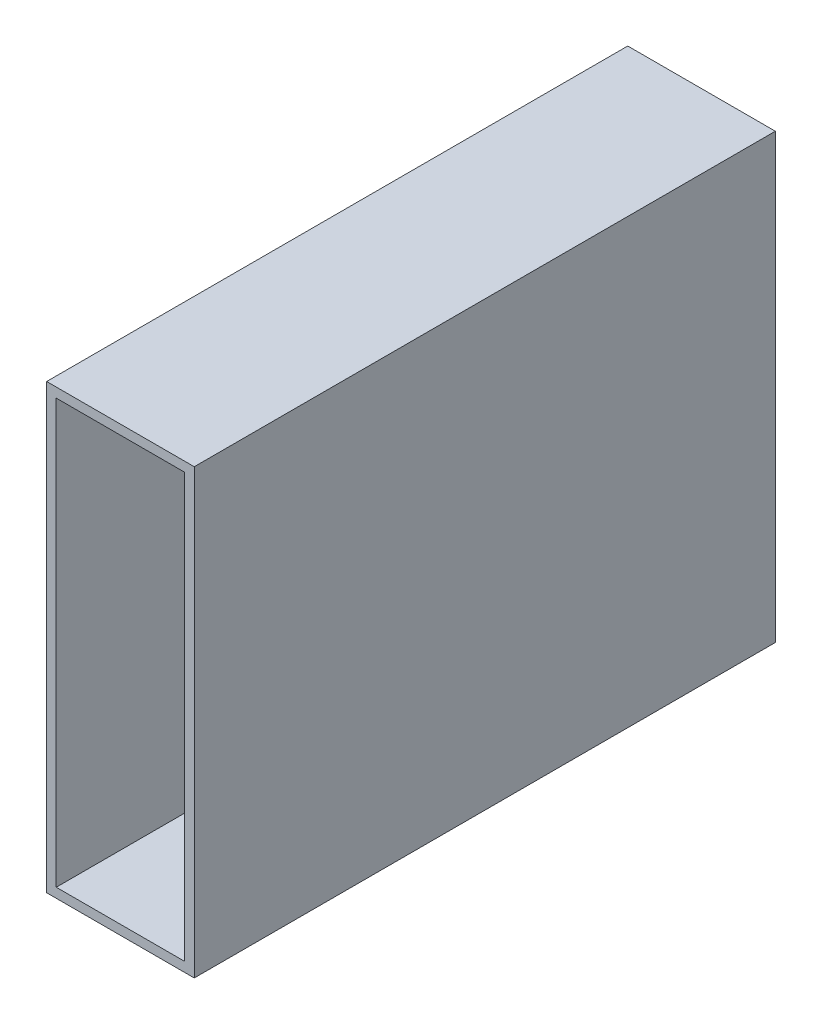
ISO-10303-21;
HEADER;
FILE_DESCRIPTION(('STEP AP214'),'2;1');
FILE_NAME('part.step','',(''),(''),'','','');
FILE_SCHEMA(('AUTOMOTIVE_DESIGN { 1 0 10303 214 1 1 1 1 }'));
ENDSEC;
DATA;
#1=APPLICATION_CONTEXT('core data for automotive mechanical design processes');
#2=APPLICATION_PROTOCOL_DEFINITION('international standard','automotive_design',2000,#1);
#3=PRODUCT_CONTEXT('',#1,'mechanical');
#4=PRODUCT('Part','Part','',(#3));
#5=PRODUCT_RELATED_PRODUCT_CATEGORY('part','',(#4));
#6=PRODUCT_DEFINITION_FORMATION('','',#4);
#7=PRODUCT_DEFINITION_CONTEXT('part definition',#1,'design');
#8=PRODUCT_DEFINITION('design','',#6,#7);
#9=PRODUCT_DEFINITION_SHAPE('','',#8);
#10=(LENGTH_UNIT() NAMED_UNIT(*) SI_UNIT(.MILLI.,.METRE.));
#11=(NAMED_UNIT(*) PLANE_ANGLE_UNIT() SI_UNIT($,.RADIAN.));
#12=(NAMED_UNIT(*) SI_UNIT($,.STERADIAN.) SOLID_ANGLE_UNIT());
#13=UNCERTAINTY_MEASURE_WITH_UNIT(LENGTH_MEASURE(1.E-05),#10,'distance_accuracy_value','');
#14=(GEOMETRIC_REPRESENTATION_CONTEXT(3) GLOBAL_UNCERTAINTY_ASSIGNED_CONTEXT((#13)) GLOBAL_UNIT_ASSIGNED_CONTEXT((#10,
#11,#12)) REPRESENTATION_CONTEXT('',''));
#15=CARTESIAN_POINT('',(0.,0.,0.));
#16=DIRECTION('',(0.,0.,1.));
#17=DIRECTION('',(1.,0.,0.));
#18=AXIS2_PLACEMENT_3D('',#15,#16,#17);
#19=CARTESIAN_POINT('',(12.7000000000002,0.,100.));
#20=DIRECTION('',(-1.,0.,0.));
#21=DIRECTION('',(0.,-1.,0.));
#22=AXIS2_PLACEMENT_3D('',#19,#20,#21);
#23=PLANE('',#22);
#24=DIRECTION('',(0.,1.,0.));
#25=VECTOR('',#24,1.);
#26=CARTESIAN_POINT('',(12.7000000000002,0.,0.));
#27=LINE('',#26,#25);
#28=CARTESIAN_POINT('',(12.7,-38.1,0.));
#29=VERTEX_POINT('',#28);
#30=CARTESIAN_POINT('',(12.7,38.1,0.));
#31=VERTEX_POINT('',#30);
#32=EDGE_CURVE('E156',#29,#31,#27,.T.);
#33=ORIENTED_EDGE('',*,*,#32,.T.);
#34=DIRECTION('',(0.,0.,-1.));
#35=VECTOR('',#34,1.);
#36=CARTESIAN_POINT('',(12.7,38.1,100.));
#37=LINE('',#36,#35);
#38=CARTESIAN_POINT('',(12.7,38.1,100.));
#39=VERTEX_POINT('',#38);
#40=EDGE_CURVE('E11',#39,#31,#37,.T.);
#41=ORIENTED_EDGE('',*,*,#40,.F.);
#42=DIRECTION('',(0.,1.,0.));
#43=VECTOR('',#42,1.);
#44=CARTESIAN_POINT('',(12.7000000000002,0.,100.));
#45=LINE('',#44,#43);
#46=CARTESIAN_POINT('',(12.7,-38.1,100.));
#47=VERTEX_POINT('',#46);
#48=EDGE_CURVE('E128',#47,#39,#45,.T.);
#49=ORIENTED_EDGE('',*,*,#48,.F.);
#50=DIRECTION('',(0.,0.,-1.));
#51=VECTOR('',#50,1.);
#52=CARTESIAN_POINT('',(12.7,-38.1,100.));
#53=LINE('',#52,#51);
#54=EDGE_CURVE('E59',#47,#29,#53,.T.);
#55=ORIENTED_EDGE('',*,*,#54,.T.);
#56=EDGE_LOOP('',(#33,#41,#49,#55));
#57=FACE_BOUND('',#56,.T.);
#58=ADVANCED_FACE('F39',(#57),#23,.F.);
#59=CARTESIAN_POINT('',(0.,38.1,100.));
#60=DIRECTION('',(0.,1.,0.));
#61=DIRECTION('',(0.,0.,1.));
#62=AXIS2_PLACEMENT_3D('',#59,#60,#61);
#63=PLANE('',#62);
#64=DIRECTION('',(1.,0.,0.));
#65=VECTOR('',#64,1.);
#66=CARTESIAN_POINT('',(0.,38.1,0.));
#67=LINE('',#66,#65);
#68=CARTESIAN_POINT('',(-12.7,38.1,0.));
#69=VERTEX_POINT('',#68);
#70=EDGE_CURVE('E117',#69,#31,#67,.T.);
#71=ORIENTED_EDGE('',*,*,#70,.F.);
#72=DIRECTION('',(0.,0.,-1.));
#73=VECTOR('',#72,1.);
#74=CARTESIAN_POINT('',(-12.7,38.1,100.));
#75=LINE('',#74,#73);
#76=CARTESIAN_POINT('',(-12.7,38.1,100.));
#77=VERTEX_POINT('',#76);
#78=EDGE_CURVE('E50',#77,#69,#75,.T.);
#79=ORIENTED_EDGE('',*,*,#78,.F.);
#80=DIRECTION('',(1.,0.,0.));
#81=VECTOR('',#80,1.);
#82=CARTESIAN_POINT('',(0.,38.1,100.));
#83=LINE('',#82,#81);
#84=EDGE_CURVE('E115',#77,#39,#83,.T.);
#85=ORIENTED_EDGE('',*,*,#84,.T.);
#86=ORIENTED_EDGE('',*,*,#40,.T.);
#87=EDGE_LOOP('',(#71,#79,#85,#86));
#88=FACE_BOUND('',#87,.T.);
#89=ADVANCED_FACE('F114',(#88),#63,.T.);
#90=CARTESIAN_POINT('',(-12.7,0.,100.));
#91=DIRECTION('',(-1.,0.,0.));
#92=DIRECTION('',(0.,0.,1.));
#93=AXIS2_PLACEMENT_3D('',#90,#91,#92);
#94=PLANE('',#93);
#95=DIRECTION('',(0.,1.,0.));
#96=VECTOR('',#95,1.);
#97=CARTESIAN_POINT('',(-12.7,0.,0.));
#98=LINE('',#97,#96);
#99=CARTESIAN_POINT('',(-12.7,-38.1,0.));
#100=VERTEX_POINT('',#99);
#101=EDGE_CURVE('E161',#100,#69,#98,.T.);
#102=ORIENTED_EDGE('',*,*,#101,.F.);
#103=DIRECTION('',(0.,0.,-1.));
#104=VECTOR('',#103,1.);
#105=CARTESIAN_POINT('',(-12.7,-38.1,100.));
#106=LINE('',#105,#104);
#107=CARTESIAN_POINT('',(-12.7,-38.1,100.));
#108=VERTEX_POINT('',#107);
#109=EDGE_CURVE('E84',#108,#100,#106,.T.);
#110=ORIENTED_EDGE('',*,*,#109,.F.);
#111=DIRECTION('',(0.,1.,0.));
#112=VECTOR('',#111,1.);
#113=CARTESIAN_POINT('',(-12.7,0.,100.));
#114=LINE('',#113,#112);
#115=EDGE_CURVE('E127',#108,#77,#114,.T.);
#116=ORIENTED_EDGE('',*,*,#115,.T.);
#117=ORIENTED_EDGE('',*,*,#78,.T.);
#118=EDGE_LOOP('',(#102,#110,#116,#117));
#119=FACE_BOUND('',#118,.T.);
#120=ADVANCED_FACE('F132',(#119),#94,.T.);
#121=CARTESIAN_POINT('',(11.049,0.,100.));
#122=DIRECTION('',(1.,0.,0.));
#123=DIRECTION('',(0.,0.,-1.));
#124=AXIS2_PLACEMENT_3D('',#121,#122,#123);
#125=PLANE('',#124);
#126=DIRECTION('',(0.,-1.,0.));
#127=VECTOR('',#126,1.);
#128=CARTESIAN_POINT('',(11.049,0.,0.));
#129=LINE('',#128,#127);
#130=CARTESIAN_POINT('',(11.049,36.449,0.));
#131=VERTEX_POINT('',#130);
#132=CARTESIAN_POINT('',(11.049,-36.449,0.));
#133=VERTEX_POINT('',#132);
#134=EDGE_CURVE('E141',#131,#133,#129,.T.);
#135=ORIENTED_EDGE('',*,*,#134,.T.);
#136=DIRECTION('',(0.,0.,-1.));
#137=VECTOR('',#136,1.);
#138=CARTESIAN_POINT('',(11.049,-36.449,100.));
#139=LINE('',#138,#137);
#140=CARTESIAN_POINT('',(11.049,-36.449,100.));
#141=VERTEX_POINT('',#140);
#142=EDGE_CURVE('E43',#141,#133,#139,.T.);
#143=ORIENTED_EDGE('',*,*,#142,.F.);
#144=DIRECTION('',(0.,-1.,0.));
#145=VECTOR('',#144,1.);
#146=CARTESIAN_POINT('',(11.049,0.,100.));
#147=LINE('',#146,#145);
#148=CARTESIAN_POINT('',(11.049,36.449,100.));
#149=VERTEX_POINT('',#148);
#150=EDGE_CURVE('E97',#149,#141,#147,.T.);
#151=ORIENTED_EDGE('',*,*,#150,.F.);
#152=DIRECTION('',(0.,0.,-1.));
#153=VECTOR('',#152,1.);
#154=CARTESIAN_POINT('',(11.049,36.449,100.));
#155=LINE('',#154,#153);
#156=EDGE_CURVE('E137',#149,#131,#155,.T.);
#157=ORIENTED_EDGE('',*,*,#156,.T.);
#158=EDGE_LOOP('',(#135,#143,#151,#157));
#159=FACE_BOUND('',#158,.T.);
#160=ADVANCED_FACE('F41',(#159),#125,.F.);
#161=CARTESIAN_POINT('',(0.,-36.449,100.));
#162=DIRECTION('',(0.,1.,0.));
#163=DIRECTION('',(0.,0.,1.));
#164=AXIS2_PLACEMENT_3D('',#161,#162,#163);
#165=PLANE('',#164);
#166=DIRECTION('',(1.,0.,0.));
#167=VECTOR('',#166,1.);
#168=CARTESIAN_POINT('',(0.,-36.449,0.));
#169=LINE('',#168,#167);
#170=CARTESIAN_POINT('',(-11.049,-36.449,0.));
#171=VERTEX_POINT('',#170);
#172=EDGE_CURVE('E145',#171,#133,#169,.T.);
#173=ORIENTED_EDGE('',*,*,#172,.F.);
#174=DIRECTION('',(0.,0.,-1.));
#175=VECTOR('',#174,1.);
#176=CARTESIAN_POINT('',(-11.049,-36.449,100.));
#177=LINE('',#176,#175);
#178=CARTESIAN_POINT('',(-11.049,-36.449,100.));
#179=VERTEX_POINT('',#178);
#180=EDGE_CURVE('E177',#179,#171,#177,.T.);
#181=ORIENTED_EDGE('',*,*,#180,.F.);
#182=DIRECTION('',(1.,0.,0.));
#183=VECTOR('',#182,1.);
#184=CARTESIAN_POINT('',(0.,-36.449,100.));
#185=LINE('',#184,#183);
#186=EDGE_CURVE('E187',#179,#141,#185,.T.);
#187=ORIENTED_EDGE('',*,*,#186,.T.);
#188=ORIENTED_EDGE('',*,*,#142,.T.);
#189=EDGE_LOOP('',(#173,#181,#187,#188));
#190=FACE_BOUND('',#189,.T.);
#191=ADVANCED_FACE('F186',(#190),#165,.T.);
#192=CARTESIAN_POINT('',(-11.049,0.,100.));
#193=DIRECTION('',(1.,0.,0.));
#194=DIRECTION('',(0.,0.,-1.));
#195=AXIS2_PLACEMENT_3D('',#192,#193,#194);
#196=PLANE('',#195);
#197=DIRECTION('',(0.,-1.,0.));
#198=VECTOR('',#197,1.);
#199=CARTESIAN_POINT('',(-11.049,0.,0.));
#200=LINE('',#199,#198);
#201=CARTESIAN_POINT('',(-11.049,36.449,0.));
#202=VERTEX_POINT('',#201);
#203=EDGE_CURVE('E149',#202,#171,#200,.T.);
#204=ORIENTED_EDGE('',*,*,#203,.F.);
#205=DIRECTION('',(0.,0.,-1.));
#206=VECTOR('',#205,1.);
#207=CARTESIAN_POINT('',(-11.049,36.449,100.));
#208=LINE('',#207,#206);
#209=CARTESIAN_POINT('',(-11.049,36.449,100.));
#210=VERTEX_POINT('',#209);
#211=EDGE_CURVE('E175',#210,#202,#208,.T.);
#212=ORIENTED_EDGE('',*,*,#211,.F.);
#213=DIRECTION('',(0.,-1.,0.));
#214=VECTOR('',#213,1.);
#215=CARTESIAN_POINT('',(-11.049,0.,100.));
#216=LINE('',#215,#214);
#217=EDGE_CURVE('E198',#210,#179,#216,.T.);
#218=ORIENTED_EDGE('',*,*,#217,.T.);
#219=ORIENTED_EDGE('',*,*,#180,.T.);
#220=EDGE_LOOP('',(#204,#212,#218,#219));
#221=FACE_BOUND('',#220,.T.);
#222=ADVANCED_FACE('F195',(#221),#196,.T.);
#223=CARTESIAN_POINT('',(0.,36.449,100.));
#224=DIRECTION('',(0.,1.,0.));
#225=DIRECTION('',(0.,0.,1.));
#226=AXIS2_PLACEMENT_3D('',#223,#224,#225);
#227=PLANE('',#226);
#228=DIRECTION('',(1.,0.,0.));
#229=VECTOR('',#228,1.);
#230=CARTESIAN_POINT('',(0.,36.449,0.));
#231=LINE('',#230,#229);
#232=EDGE_CURVE('E153',#202,#131,#231,.T.);
#233=ORIENTED_EDGE('',*,*,#232,.T.);
#234=ORIENTED_EDGE('',*,*,#156,.F.);
#235=DIRECTION('',(1.,0.,0.));
#236=VECTOR('',#235,1.);
#237=CARTESIAN_POINT('',(0.,36.449,100.));
#238=LINE('',#237,#236);
#239=EDGE_CURVE('E200',#210,#149,#238,.T.);
#240=ORIENTED_EDGE('',*,*,#239,.F.);
#241=ORIENTED_EDGE('',*,*,#211,.T.);
#242=EDGE_LOOP('',(#233,#234,#240,#241));
#243=FACE_BOUND('',#242,.T.);
#244=ADVANCED_FACE('F201',(#243),#227,.F.);
#245=CARTESIAN_POINT('',(0.,-38.1,100.));
#246=DIRECTION('',(0.,-1.,0.));
#247=DIRECTION('',(0.,0.,-1.));
#248=AXIS2_PLACEMENT_3D('',#245,#246,#247);
#249=PLANE('',#248);
#250=DIRECTION('',(-1.,0.,0.));
#251=VECTOR('',#250,1.);
#252=CARTESIAN_POINT('',(0.,-38.1,0.));
#253=LINE('',#252,#251);
#254=EDGE_CURVE('E164',#29,#100,#253,.T.);
#255=ORIENTED_EDGE('',*,*,#254,.F.);
#256=ORIENTED_EDGE('',*,*,#54,.F.);
#257=DIRECTION('',(-1.,0.,0.));
#258=VECTOR('',#257,1.);
#259=CARTESIAN_POINT('',(0.,-38.1,100.));
#260=LINE('',#259,#258);
#261=EDGE_CURVE('E134',#47,#108,#260,.T.);
#262=ORIENTED_EDGE('',*,*,#261,.T.);
#263=ORIENTED_EDGE('',*,*,#109,.T.);
#264=EDGE_LOOP('',(#255,#256,#262,#263));
#265=FACE_BOUND('',#264,.T.);
#266=ADVANCED_FACE('F212',(#265),#249,.T.);
#267=CARTESIAN_POINT('',(0.,0.,100.));
#268=DIRECTION('',(0.,0.,1.));
#269=DIRECTION('',(1.,0.,0.));
#270=AXIS2_PLACEMENT_3D('',#267,#268,#269);
#271=PLANE('',#270);
#272=ORIENTED_EDGE('',*,*,#150,.T.);
#273=ORIENTED_EDGE('',*,*,#186,.F.);
#274=ORIENTED_EDGE('',*,*,#217,.F.);
#275=ORIENTED_EDGE('',*,*,#239,.T.);
#276=EDGE_LOOP('',(#272,#273,#274,#275));
#277=FACE_BOUND('',#276,.T.);
#278=ORIENTED_EDGE('',*,*,#48,.T.);
#279=ORIENTED_EDGE('',*,*,#84,.F.);
#280=ORIENTED_EDGE('',*,*,#115,.F.);
#281=ORIENTED_EDGE('',*,*,#261,.F.);
#282=EDGE_LOOP('',(#278,#279,#280,#281));
#283=FACE_BOUND('',#282,.T.);
#284=ADVANCED_FACE('F125',(#277,#283),#271,.T.);
#285=CARTESIAN_POINT('',(0.,0.,0.));
#286=DIRECTION('',(0.,0.,1.));
#287=DIRECTION('',(1.,0.,0.));
#288=AXIS2_PLACEMENT_3D('',#285,#286,#287);
#289=PLANE('',#288);
#290=ORIENTED_EDGE('',*,*,#134,.F.);
#291=ORIENTED_EDGE('',*,*,#232,.F.);
#292=ORIENTED_EDGE('',*,*,#203,.T.);
#293=ORIENTED_EDGE('',*,*,#172,.T.);
#294=EDGE_LOOP('',(#290,#291,#292,#293));
#295=FACE_BOUND('',#294,.T.);
#296=ORIENTED_EDGE('',*,*,#32,.F.);
#297=ORIENTED_EDGE('',*,*,#254,.T.);
#298=ORIENTED_EDGE('',*,*,#101,.T.);
#299=ORIENTED_EDGE('',*,*,#70,.T.);
#300=EDGE_LOOP('',(#296,#297,#298,#299));
#301=FACE_BOUND('',#300,.T.);
#302=ADVANCED_FACE('F193',(#295,#301),#289,.F.);
#303=CLOSED_SHELL('',(#58,#89,#120,#160,#191,#222,#244,#266,#284,#302));
#304=MANIFOLD_SOLID_BREP('B2',#303);
#305=ADVANCED_BREP_SHAPE_REPRESENTATION('',(#18,#304),#14);
#306=SHAPE_DEFINITION_REPRESENTATION(#9,#305);
ENDSEC;
END-ISO-10303-21;
